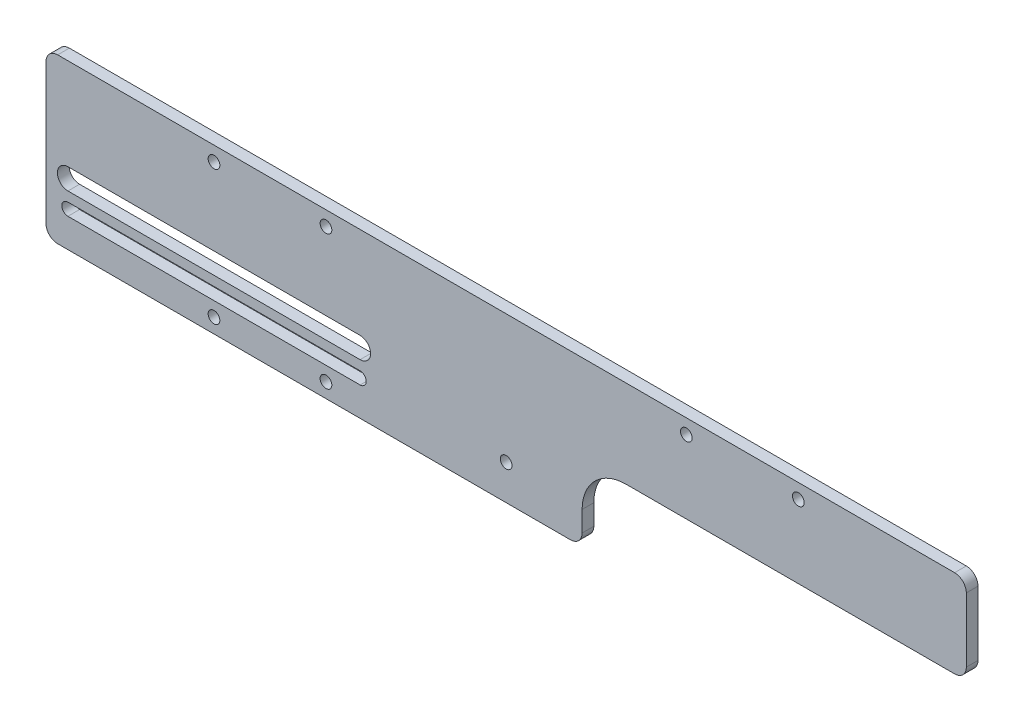
ISO-10303-21;
HEADER;
FILE_DESCRIPTION(('STEP AP214'),'2;1');
FILE_NAME('part.step','',(''),(''),'','','');
FILE_SCHEMA(('AUTOMOTIVE_DESIGN { 1 0 10303 214 1 1 1 1 }'));
ENDSEC;
DATA;
#1=APPLICATION_CONTEXT('core data for automotive mechanical design processes');
#2=APPLICATION_PROTOCOL_DEFINITION('international standard','automotive_design',2000,#1);
#3=PRODUCT_CONTEXT('',#1,'mechanical');
#4=PRODUCT('Part','Part','',(#3));
#5=PRODUCT_RELATED_PRODUCT_CATEGORY('part','',(#4));
#6=PRODUCT_DEFINITION_FORMATION('','',#4);
#7=PRODUCT_DEFINITION_CONTEXT('part definition',#1,'design');
#8=PRODUCT_DEFINITION('design','',#6,#7);
#9=PRODUCT_DEFINITION_SHAPE('','',#8);
#10=(LENGTH_UNIT() NAMED_UNIT(*) SI_UNIT(.MILLI.,.METRE.));
#11=(NAMED_UNIT(*) PLANE_ANGLE_UNIT() SI_UNIT($,.RADIAN.));
#12=(NAMED_UNIT(*) SI_UNIT($,.STERADIAN.) SOLID_ANGLE_UNIT());
#13=UNCERTAINTY_MEASURE_WITH_UNIT(LENGTH_MEASURE(1.E-05),#10,'distance_accuracy_value','');
#14=(GEOMETRIC_REPRESENTATION_CONTEXT(3) GLOBAL_UNCERTAINTY_ASSIGNED_CONTEXT((#13)) GLOBAL_UNIT_ASSIGNED_CONTEXT((#10,
#11,#12)) REPRESENTATION_CONTEXT('',''));
#15=CARTESIAN_POINT('',(0.,0.,0.));
#16=DIRECTION('',(0.,0.,1.));
#17=DIRECTION('',(1.,0.,0.));
#18=AXIS2_PLACEMENT_3D('',#15,#16,#17);
#19=CARTESIAN_POINT('',(26.,0.,0.));
#20=DIRECTION('',(1.,0.,0.));
#21=DIRECTION('',(0.,0.,-1.));
#22=AXIS2_PLACEMENT_3D('',#19,#20,#21);
#23=PLANE('',#22);
#24=DIRECTION('',(0.,1.,0.));
#25=VECTOR('',#24,1.);
#26=CARTESIAN_POINT('',(26.,0.,0.));
#27=LINE('',#26,#25);
#28=CARTESIAN_POINT('',(26.,-24.,0.));
#29=VERTEX_POINT('',#28);
#30=CARTESIAN_POINT('',(26.,-17.,0.));
#31=VERTEX_POINT('',#30);
#32=EDGE_CURVE('E253',#29,#31,#27,.T.);
#33=ORIENTED_EDGE('',*,*,#32,.T.);
#34=DIRECTION('',(0.,0.,1.));
#35=VECTOR('',#34,1.);
#36=CARTESIAN_POINT('',(26.,-17.,0.));
#37=LINE('',#36,#35);
#38=CARTESIAN_POINT('',(26.,-17.,4.));
#39=VERTEX_POINT('',#38);
#40=EDGE_CURVE('E242',#31,#39,#37,.T.);
#41=ORIENTED_EDGE('',*,*,#40,.T.);
#42=DIRECTION('',(0.,1.,0.));
#43=VECTOR('',#42,1.);
#44=CARTESIAN_POINT('',(26.,0.,4.));
#45=LINE('',#44,#43);
#46=CARTESIAN_POINT('',(26.,-24.,4.));
#47=VERTEX_POINT('',#46);
#48=EDGE_CURVE('E254',#47,#39,#45,.T.);
#49=ORIENTED_EDGE('',*,*,#48,.F.);
#50=DIRECTION('',(0.,0.,1.));
#51=VECTOR('',#50,1.);
#52=CARTESIAN_POINT('',(26.,-24.,0.));
#53=LINE('',#52,#51);
#54=EDGE_CURVE('E265',#29,#47,#53,.T.);
#55=ORIENTED_EDGE('',*,*,#54,.F.);
#56=EDGE_LOOP('',(#33,#41,#49,#55));
#57=FACE_BOUND('',#56,.T.);
#58=ADVANCED_FACE('F41',(#57),#23,.T.);
#59=CARTESIAN_POINT('',(153.5,-24.,4.));
#60=DIRECTION('',(0.,0.,-1.));
#61=DIRECTION('',(-1.,0.,0.));
#62=AXIS2_PLACEMENT_3D('',#59,#60,#61);
#63=PLANE('',#62);
#64=DIRECTION('',(-1.,0.,0.));
#65=VECTOR('',#64,1.);
#66=CARTESIAN_POINT('',(-50.,-3.40000000000004,4.));
#67=LINE('',#66,#65);
#68=CARTESIAN_POINT('',(-50.,-3.40000000000004,4.));
#69=VERTEX_POINT('',#68);
#70=CARTESIAN_POINT('',(-150.,-3.40000000000005,4.));
#71=VERTEX_POINT('',#70);
#72=EDGE_CURVE('E213',#69,#71,#67,.T.);
#73=ORIENTED_EDGE('',*,*,#72,.F.);
#74=CARTESIAN_POINT('',(-50.,-7.00000000000004,4.));
#75=DIRECTION('',(0.,0.,1.));
#76=DIRECTION('',(1.,0.,0.));
#77=AXIS2_PLACEMENT_3D('',#74,#75,#76);
#78=CIRCLE('',#77,3.6);
#79=CARTESIAN_POINT('',(-50.,-10.6,4.));
#80=VERTEX_POINT('',#79);
#81=EDGE_CURVE('E57',#80,#69,#78,.T.);
#82=ORIENTED_EDGE('',*,*,#81,.F.);
#83=DIRECTION('',(1.,0.,0.));
#84=VECTOR('',#83,1.);
#85=CARTESIAN_POINT('',(-50.,-10.6,4.));
#86=LINE('',#85,#84);
#87=CARTESIAN_POINT('',(-150.,-10.6000000000001,4.));
#88=VERTEX_POINT('',#87);
#89=EDGE_CURVE('E200',#88,#80,#86,.T.);
#90=ORIENTED_EDGE('',*,*,#89,.F.);
#91=CARTESIAN_POINT('',(-150.,-7.00000000000005,4.));
#92=DIRECTION('',(0.,0.,1.));
#93=DIRECTION('',(1.,0.,0.));
#94=AXIS2_PLACEMENT_3D('',#91,#92,#93);
#95=CIRCLE('',#94,3.6);
#96=EDGE_CURVE('E204',#71,#88,#95,.T.);
#97=ORIENTED_EDGE('',*,*,#96,.F.);
#98=EDGE_LOOP('',(#73,#82,#90,#97));
#99=FACE_BOUND('',#98,.T.);
#100=CARTESIAN_POINT('',(0.,-16.0000000000001,4.));
#101=DIRECTION('',(0.,0.,1.));
#102=DIRECTION('',(1.,0.,0.));
#103=AXIS2_PLACEMENT_3D('',#100,#101,#102);
#104=CIRCLE('',#103,2.00000000000001);
#105=CARTESIAN_POINT('',(2.00000000000002,-16.0000000000001,4.));
#106=VERTEX_POINT('',#105);
#107=EDGE_CURVE('E222',#106,#106,#104,.T.);
#108=ORIENTED_EDGE('',*,*,#107,.F.);
#109=EDGE_LOOP('',(#108));
#110=FACE_BOUND('',#109,.T.);
#111=CARTESIAN_POINT('',(41.,-17.,4.));
#112=DIRECTION('',(0.,0.,1.));
#113=DIRECTION('',(1.,0.,0.));
#114=AXIS2_PLACEMENT_3D('',#111,#112,#113);
#115=CIRCLE('',#114,15.);
#116=CARTESIAN_POINT('',(41.,-1.99999999999999,4.));
#117=VERTEX_POINT('',#116);
#118=EDGE_CURVE('E232',#117,#39,#115,.T.);
#119=ORIENTED_EDGE('',*,*,#118,.F.);
#120=DIRECTION('',(1.,0.,0.));
#121=VECTOR('',#120,1.);
#122=CARTESIAN_POINT('',(0.,-1.99999999999999,4.));
#123=LINE('',#122,#121);
#124=CARTESIAN_POINT('',(153.5,-1.99999999999999,4.));
#125=VERTEX_POINT('',#124);
#126=EDGE_CURVE('E276',#117,#125,#123,.T.);
#127=ORIENTED_EDGE('',*,*,#126,.T.);
#128=CARTESIAN_POINT('',(153.5,2.00000000000001,4.));
#129=DIRECTION('',(0.,0.,1.));
#130=DIRECTION('',(1.,0.,0.));
#131=AXIS2_PLACEMENT_3D('',#128,#129,#130);
#132=CIRCLE('',#131,4.);
#133=CARTESIAN_POINT('',(157.5,2.00000000000001,4.));
#134=VERTEX_POINT('',#133);
#135=EDGE_CURVE('E268',#125,#134,#132,.T.);
#136=ORIENTED_EDGE('',*,*,#135,.T.);
#137=DIRECTION('',(0.,1.,0.));
#138=VECTOR('',#137,1.);
#139=CARTESIAN_POINT('',(157.5,-24.,4.));
#140=LINE('',#139,#138);
#141=CARTESIAN_POINT('',(157.5,24.,4.));
#142=VERTEX_POINT('',#141);
#143=EDGE_CURVE('E383',#134,#142,#140,.T.);
#144=ORIENTED_EDGE('',*,*,#143,.T.);
#145=CARTESIAN_POINT('',(153.5,24.,4.));
#146=DIRECTION('',(0.,0.,1.));
#147=DIRECTION('',(1.,0.,0.));
#148=AXIS2_PLACEMENT_3D('',#145,#146,#147);
#149=CIRCLE('',#148,4.00000000000001);
#150=CARTESIAN_POINT('',(153.5,28.,4.));
#151=VERTEX_POINT('',#150);
#152=EDGE_CURVE('E386',#142,#151,#149,.T.);
#153=ORIENTED_EDGE('',*,*,#152,.T.);
#154=DIRECTION('',(-1.,0.,0.));
#155=VECTOR('',#154,1.);
#156=CARTESIAN_POINT('',(153.5,28.,4.));
#157=LINE('',#156,#155);
#158=CARTESIAN_POINT('',(-153.5,28.,4.));
#159=VERTEX_POINT('',#158);
#160=EDGE_CURVE('E390',#151,#159,#157,.T.);
#161=ORIENTED_EDGE('',*,*,#160,.T.);
#162=CARTESIAN_POINT('',(-153.5,24.,4.));
#163=DIRECTION('',(0.,0.,1.));
#164=DIRECTION('',(-1.,0.,0.));
#165=AXIS2_PLACEMENT_3D('',#162,#163,#164);
#166=CIRCLE('',#165,4.00000000000001);
#167=CARTESIAN_POINT('',(-157.5,24.,4.));
#168=VERTEX_POINT('',#167);
#169=EDGE_CURVE('E393',#159,#168,#166,.T.);
#170=ORIENTED_EDGE('',*,*,#169,.T.);
#171=DIRECTION('',(0.,-1.,0.));
#172=VECTOR('',#171,1.);
#173=CARTESIAN_POINT('',(-157.5,-24.0000000000001,4.));
#174=LINE('',#173,#172);
#175=CARTESIAN_POINT('',(-157.5,-24.0000000000001,4.));
#176=VERTEX_POINT('',#175);
#177=EDGE_CURVE('E396',#168,#176,#174,.T.);
#178=ORIENTED_EDGE('',*,*,#177,.T.);
#179=CARTESIAN_POINT('',(-153.5,-24.0000000000001,4.));
#180=DIRECTION('',(0.,0.,1.));
#181=DIRECTION('',(1.,0.,0.));
#182=AXIS2_PLACEMENT_3D('',#179,#180,#181);
#183=CIRCLE('',#182,4.00000000000001);
#184=CARTESIAN_POINT('',(-153.5,-28.0000000000001,4.));
#185=VERTEX_POINT('',#184);
#186=EDGE_CURVE('E399',#176,#185,#183,.T.);
#187=ORIENTED_EDGE('',*,*,#186,.T.);
#188=DIRECTION('',(1.,0.,0.));
#189=VECTOR('',#188,1.);
#190=CARTESIAN_POINT('',(153.5,-28.,4.));
#191=LINE('',#190,#189);
#192=CARTESIAN_POINT('',(21.9999999999999,-28.,4.));
#193=VERTEX_POINT('',#192);
#194=EDGE_CURVE('E402',#185,#193,#191,.T.);
#195=ORIENTED_EDGE('',*,*,#194,.T.);
#196=CARTESIAN_POINT('',(22.,-24.,4.));
#197=DIRECTION('',(0.,0.,1.));
#198=DIRECTION('',(1.,0.,0.));
#199=AXIS2_PLACEMENT_3D('',#196,#197,#198);
#200=CIRCLE('',#199,4.);
#201=EDGE_CURVE('E246',#47,#193,#200,.F.);
#202=ORIENTED_EDGE('',*,*,#201,.F.);
#203=ORIENTED_EDGE('',*,*,#48,.T.);
#204=EDGE_LOOP('',(#119,#127,#136,#144,#153,#161,#170,#178,#187,#195,#202,#203));
#205=FACE_BOUND('',#204,.T.);
#206=CARTESIAN_POINT('',(-150.,-16.0000000000001,4.));
#207=DIRECTION('',(0.,0.,1.));
#208=DIRECTION('',(1.,0.,0.));
#209=AXIS2_PLACEMENT_3D('',#206,#207,#208);
#210=CIRCLE('',#209,2.1);
#211=CARTESIAN_POINT('',(-150.,-13.9000000000001,4.));
#212=VERTEX_POINT('',#211);
#213=CARTESIAN_POINT('',(-150.,-18.1000000000001,4.));
#214=VERTEX_POINT('',#213);
#215=EDGE_CURVE('E340',#212,#214,#210,.T.);
#216=ORIENTED_EDGE('',*,*,#215,.F.);
#217=DIRECTION('',(-1.,0.,0.));
#218=VECTOR('',#217,1.);
#219=CARTESIAN_POINT('',(-150.,-13.9000000000001,4.));
#220=LINE('',#219,#218);
#221=CARTESIAN_POINT('',(-50.,-13.9,4.));
#222=VERTEX_POINT('',#221);
#223=EDGE_CURVE('E351',#222,#212,#220,.T.);
#224=ORIENTED_EDGE('',*,*,#223,.F.);
#225=CARTESIAN_POINT('',(-50.,-16.,4.));
#226=DIRECTION('',(0.,0.,1.));
#227=DIRECTION('',(1.,0.,0.));
#228=AXIS2_PLACEMENT_3D('',#225,#226,#227);
#229=CIRCLE('',#228,2.1);
#230=CARTESIAN_POINT('',(-50.,-18.1,4.));
#231=VERTEX_POINT('',#230);
#232=EDGE_CURVE('E347',#231,#222,#229,.T.);
#233=ORIENTED_EDGE('',*,*,#232,.F.);
#234=DIRECTION('',(1.,0.,0.));
#235=VECTOR('',#234,1.);
#236=CARTESIAN_POINT('',(-150.,-18.1000000000001,4.));
#237=LINE('',#236,#235);
#238=EDGE_CURVE('E343',#214,#231,#237,.T.);
#239=ORIENTED_EDGE('',*,*,#238,.F.);
#240=EDGE_LOOP('',(#216,#224,#233,#239));
#241=FACE_BOUND('',#240,.T.);
#242=CARTESIAN_POINT('',(-100.,23.,4.));
#243=DIRECTION('',(0.,0.,1.));
#244=DIRECTION('',(1.,0.,0.));
#245=AXIS2_PLACEMENT_3D('',#242,#243,#244);
#246=CIRCLE('',#245,2.);
#247=CARTESIAN_POINT('',(-98.,23.,4.));
#248=VERTEX_POINT('',#247);
#249=EDGE_CURVE('E332',#248,#248,#246,.T.);
#250=ORIENTED_EDGE('',*,*,#249,.F.);
#251=EDGE_LOOP('',(#250));
#252=FACE_BOUND('',#251,.T.);
#253=CARTESIAN_POINT('',(-61.67,23.,4.));
#254=DIRECTION('',(0.,0.,1.));
#255=DIRECTION('',(1.,0.,0.));
#256=AXIS2_PLACEMENT_3D('',#253,#254,#255);
#257=CIRCLE('',#256,2.);
#258=CARTESIAN_POINT('',(-59.67,23.,4.));
#259=VERTEX_POINT('',#258);
#260=EDGE_CURVE('E324',#259,#259,#257,.T.);
#261=ORIENTED_EDGE('',*,*,#260,.F.);
#262=EDGE_LOOP('',(#261));
#263=FACE_BOUND('',#262,.T.);
#264=CARTESIAN_POINT('',(-100.,-23.,4.));
#265=DIRECTION('',(0.,0.,1.));
#266=DIRECTION('',(1.,0.,0.));
#267=AXIS2_PLACEMENT_3D('',#264,#265,#266);
#268=CIRCLE('',#267,2.);
#269=CARTESIAN_POINT('',(-98.,-23.,4.));
#270=VERTEX_POINT('',#269);
#271=EDGE_CURVE('E316',#270,#270,#268,.T.);
#272=ORIENTED_EDGE('',*,*,#271,.F.);
#273=EDGE_LOOP('',(#272));
#274=FACE_BOUND('',#273,.T.);
#275=CARTESIAN_POINT('',(-61.67,-23.,4.));
#276=DIRECTION('',(0.,0.,1.));
#277=DIRECTION('',(1.,0.,0.));
#278=AXIS2_PLACEMENT_3D('',#275,#276,#277);
#279=CIRCLE('',#278,2.);
#280=CARTESIAN_POINT('',(-59.67,-23.,4.));
#281=VERTEX_POINT('',#280);
#282=EDGE_CURVE('E308',#281,#281,#279,.T.);
#283=ORIENTED_EDGE('',*,*,#282,.F.);
#284=EDGE_LOOP('',(#283));
#285=FACE_BOUND('',#284,.T.);
#286=CARTESIAN_POINT('',(61.67,23.,4.));
#287=DIRECTION('',(0.,0.,1.));
#288=DIRECTION('',(-1.,0.,0.));
#289=AXIS2_PLACEMENT_3D('',#286,#287,#288);
#290=CIRCLE('',#289,1.99999999999998);
#291=CARTESIAN_POINT('',(59.67,23.,4.));
#292=VERTEX_POINT('',#291);
#293=EDGE_CURVE('E300',#292,#292,#290,.T.);
#294=ORIENTED_EDGE('',*,*,#293,.F.);
#295=EDGE_LOOP('',(#294));
#296=FACE_BOUND('',#295,.T.);
#297=CARTESIAN_POINT('',(100.,23.,4.));
#298=DIRECTION('',(0.,0.,1.));
#299=DIRECTION('',(-1.,0.,0.));
#300=AXIS2_PLACEMENT_3D('',#297,#298,#299);
#301=CIRCLE('',#300,2.);
#302=CARTESIAN_POINT('',(98.,23.,4.));
#303=VERTEX_POINT('',#302);
#304=EDGE_CURVE('E292',#303,#303,#301,.T.);
#305=ORIENTED_EDGE('',*,*,#304,.F.);
#306=EDGE_LOOP('',(#305));
#307=FACE_BOUND('',#306,.T.);
#308=ADVANCED_FACE('F468',(#99,#110,#205,#241,#252,#263,#274,#285,#296,#307),#63,.F.);
#309=CARTESIAN_POINT('',(153.5,-24.,0.));
#310=DIRECTION('',(0.,0.,-1.));
#311=DIRECTION('',(-1.,0.,0.));
#312=AXIS2_PLACEMENT_3D('',#309,#310,#311);
#313=PLANE('',#312);
#314=CARTESIAN_POINT('',(-50.,-7.00000000000004,0.));
#315=DIRECTION('',(0.,0.,1.));
#316=DIRECTION('',(1.,0.,0.));
#317=AXIS2_PLACEMENT_3D('',#314,#315,#316);
#318=CIRCLE('',#317,3.6);
#319=CARTESIAN_POINT('',(-50.,-10.6,0.));
#320=VERTEX_POINT('',#319);
#321=CARTESIAN_POINT('',(-50.,-3.40000000000004,0.));
#322=VERTEX_POINT('',#321);
#323=EDGE_CURVE('E181',#320,#322,#318,.T.);
#324=ORIENTED_EDGE('',*,*,#323,.T.);
#325=DIRECTION('',(-1.,0.,0.));
#326=VECTOR('',#325,1.);
#327=CARTESIAN_POINT('',(-50.,-3.40000000000004,0.));
#328=LINE('',#327,#326);
#329=CARTESIAN_POINT('',(-150.,-3.40000000000005,0.));
#330=VERTEX_POINT('',#329);
#331=EDGE_CURVE('E191',#322,#330,#328,.T.);
#332=ORIENTED_EDGE('',*,*,#331,.T.);
#333=CARTESIAN_POINT('',(-150.,-7.00000000000005,0.));
#334=DIRECTION('',(0.,0.,1.));
#335=DIRECTION('',(1.,0.,0.));
#336=AXIS2_PLACEMENT_3D('',#333,#334,#335);
#337=CIRCLE('',#336,3.6);
#338=CARTESIAN_POINT('',(-150.,-10.6000000000001,0.));
#339=VERTEX_POINT('',#338);
#340=EDGE_CURVE('E65',#330,#339,#337,.T.);
#341=ORIENTED_EDGE('',*,*,#340,.T.);
#342=DIRECTION('',(1.,0.,0.));
#343=VECTOR('',#342,1.);
#344=CARTESIAN_POINT('',(-50.,-10.6,0.));
#345=LINE('',#344,#343);
#346=EDGE_CURVE('E188',#339,#320,#345,.T.);
#347=ORIENTED_EDGE('',*,*,#346,.T.);
#348=EDGE_LOOP('',(#324,#332,#341,#347));
#349=FACE_BOUND('',#348,.T.);
#350=CARTESIAN_POINT('',(0.,-16.0000000000001,0.));
#351=DIRECTION('',(0.,0.,1.));
#352=DIRECTION('',(1.,0.,0.));
#353=AXIS2_PLACEMENT_3D('',#350,#351,#352);
#354=CIRCLE('',#353,2.00000000000001);
#355=CARTESIAN_POINT('',(2.00000000000002,-16.0000000000001,0.));
#356=VERTEX_POINT('',#355);
#357=EDGE_CURVE('E228',#356,#356,#354,.T.);
#358=ORIENTED_EDGE('',*,*,#357,.T.);
#359=EDGE_LOOP('',(#358));
#360=FACE_BOUND('',#359,.T.);
#361=DIRECTION('',(1.,0.,0.));
#362=VECTOR('',#361,1.);
#363=CARTESIAN_POINT('',(0.,-1.99999999999999,0.));
#364=LINE('',#363,#362);
#365=CARTESIAN_POINT('',(41.,-1.99999999999999,0.));
#366=VERTEX_POINT('',#365);
#367=CARTESIAN_POINT('',(153.5,-1.99999999999999,0.));
#368=VERTEX_POINT('',#367);
#369=EDGE_CURVE('E275',#366,#368,#364,.T.);
#370=ORIENTED_EDGE('',*,*,#369,.F.);
#371=CARTESIAN_POINT('',(41.,-17.,0.));
#372=DIRECTION('',(0.,0.,1.));
#373=DIRECTION('',(1.,0.,0.));
#374=AXIS2_PLACEMENT_3D('',#371,#372,#373);
#375=CIRCLE('',#374,15.);
#376=EDGE_CURVE('E236',#366,#31,#375,.T.);
#377=ORIENTED_EDGE('',*,*,#376,.T.);
#378=ORIENTED_EDGE('',*,*,#32,.F.);
#379=CARTESIAN_POINT('',(22.,-24.,0.));
#380=DIRECTION('',(0.,0.,1.));
#381=DIRECTION('',(1.,0.,0.));
#382=AXIS2_PLACEMENT_3D('',#379,#380,#381);
#383=CIRCLE('',#382,4.);
#384=CARTESIAN_POINT('',(21.9999999999999,-28.,0.));
#385=VERTEX_POINT('',#384);
#386=EDGE_CURVE('E249',#29,#385,#383,.F.);
#387=ORIENTED_EDGE('',*,*,#386,.T.);
#388=DIRECTION('',(1.,0.,0.));
#389=VECTOR('',#388,1.);
#390=CARTESIAN_POINT('',(153.5,-28.,0.));
#391=LINE('',#390,#389);
#392=CARTESIAN_POINT('',(-153.5,-28.0000000000001,0.));
#393=VERTEX_POINT('',#392);
#394=EDGE_CURVE('E387',#393,#385,#391,.T.);
#395=ORIENTED_EDGE('',*,*,#394,.F.);
#396=CARTESIAN_POINT('',(-153.5,-24.0000000000001,0.));
#397=DIRECTION('',(0.,0.,1.));
#398=DIRECTION('',(1.,0.,0.));
#399=AXIS2_PLACEMENT_3D('',#396,#397,#398);
#400=CIRCLE('',#399,4.00000000000001);
#401=CARTESIAN_POINT('',(-157.5,-24.0000000000001,0.));
#402=VERTEX_POINT('',#401);
#403=EDGE_CURVE('E420',#402,#393,#400,.T.);
#404=ORIENTED_EDGE('',*,*,#403,.F.);
#405=DIRECTION('',(0.,-1.,0.));
#406=VECTOR('',#405,1.);
#407=CARTESIAN_POINT('',(-157.5,-24.0000000000001,0.));
#408=LINE('',#407,#406);
#409=CARTESIAN_POINT('',(-157.5,24.,0.));
#410=VERTEX_POINT('',#409);
#411=EDGE_CURVE('E417',#410,#402,#408,.T.);
#412=ORIENTED_EDGE('',*,*,#411,.F.);
#413=CARTESIAN_POINT('',(-153.5,24.,0.));
#414=DIRECTION('',(0.,0.,1.));
#415=DIRECTION('',(-1.,0.,0.));
#416=AXIS2_PLACEMENT_3D('',#413,#414,#415);
#417=CIRCLE('',#416,4.00000000000001);
#418=CARTESIAN_POINT('',(-153.5,28.,0.));
#419=VERTEX_POINT('',#418);
#420=EDGE_CURVE('E414',#419,#410,#417,.T.);
#421=ORIENTED_EDGE('',*,*,#420,.F.);
#422=DIRECTION('',(-1.,0.,0.));
#423=VECTOR('',#422,1.);
#424=CARTESIAN_POINT('',(153.5,28.,0.));
#425=LINE('',#424,#423);
#426=CARTESIAN_POINT('',(153.5,28.,0.));
#427=VERTEX_POINT('',#426);
#428=EDGE_CURVE('E411',#427,#419,#425,.T.);
#429=ORIENTED_EDGE('',*,*,#428,.F.);
#430=CARTESIAN_POINT('',(153.5,24.,0.));
#431=DIRECTION('',(0.,0.,1.));
#432=DIRECTION('',(1.,0.,0.));
#433=AXIS2_PLACEMENT_3D('',#430,#431,#432);
#434=CIRCLE('',#433,4.00000000000001);
#435=CARTESIAN_POINT('',(157.5,24.,0.));
#436=VERTEX_POINT('',#435);
#437=EDGE_CURVE('E408',#436,#427,#434,.T.);
#438=ORIENTED_EDGE('',*,*,#437,.F.);
#439=DIRECTION('',(0.,1.,0.));
#440=VECTOR('',#439,1.);
#441=CARTESIAN_POINT('',(157.5,-24.,0.));
#442=LINE('',#441,#440);
#443=CARTESIAN_POINT('',(157.5,2.00000000000001,0.));
#444=VERTEX_POINT('',#443);
#445=EDGE_CURVE('E382',#444,#436,#442,.T.);
#446=ORIENTED_EDGE('',*,*,#445,.F.);
#447=CARTESIAN_POINT('',(153.5,2.00000000000001,0.));
#448=DIRECTION('',(0.,0.,1.));
#449=DIRECTION('',(1.,0.,0.));
#450=AXIS2_PLACEMENT_3D('',#447,#448,#449);
#451=CIRCLE('',#450,4.);
#452=EDGE_CURVE('E272',#368,#444,#451,.T.);
#453=ORIENTED_EDGE('',*,*,#452,.F.);
#454=EDGE_LOOP('',(#370,#377,#378,#387,#395,#404,#412,#421,#429,#438,#446,#453));
#455=FACE_BOUND('',#454,.T.);
#456=CARTESIAN_POINT('',(-100.,-23.,0.));
#457=DIRECTION('',(0.,0.,1.));
#458=DIRECTION('',(1.,0.,0.));
#459=AXIS2_PLACEMENT_3D('',#456,#457,#458);
#460=CIRCLE('',#459,2.);
#461=CARTESIAN_POINT('',(-98.,-23.,0.));
#462=VERTEX_POINT('',#461);
#463=EDGE_CURVE('E312',#462,#462,#460,.T.);
#464=ORIENTED_EDGE('',*,*,#463,.T.);
#465=EDGE_LOOP('',(#464));
#466=FACE_BOUND('',#465,.T.);
#467=CARTESIAN_POINT('',(-100.,23.,0.));
#468=DIRECTION('',(0.,0.,1.));
#469=DIRECTION('',(1.,0.,0.));
#470=AXIS2_PLACEMENT_3D('',#467,#468,#469);
#471=CIRCLE('',#470,2.);
#472=CARTESIAN_POINT('',(-98.,23.,0.));
#473=VERTEX_POINT('',#472);
#474=EDGE_CURVE('E328',#473,#473,#471,.T.);
#475=ORIENTED_EDGE('',*,*,#474,.T.);
#476=EDGE_LOOP('',(#475));
#477=FACE_BOUND('',#476,.T.);
#478=DIRECTION('',(-1.,0.,0.));
#479=VECTOR('',#478,1.);
#480=CARTESIAN_POINT('',(-150.,-13.9000000000001,0.));
#481=LINE('',#480,#479);
#482=CARTESIAN_POINT('',(-50.,-13.9,0.));
#483=VERTEX_POINT('',#482);
#484=CARTESIAN_POINT('',(-150.,-13.9000000000001,0.));
#485=VERTEX_POINT('',#484);
#486=EDGE_CURVE('E344',#483,#485,#481,.T.);
#487=ORIENTED_EDGE('',*,*,#486,.T.);
#488=CARTESIAN_POINT('',(-150.,-16.0000000000001,0.));
#489=DIRECTION('',(0.,0.,1.));
#490=DIRECTION('',(1.,0.,0.));
#491=AXIS2_PLACEMENT_3D('',#488,#489,#490);
#492=CIRCLE('',#491,2.1);
#493=CARTESIAN_POINT('',(-150.,-18.1000000000001,0.));
#494=VERTEX_POINT('',#493);
#495=EDGE_CURVE('E336',#485,#494,#492,.T.);
#496=ORIENTED_EDGE('',*,*,#495,.T.);
#497=DIRECTION('',(1.,0.,0.));
#498=VECTOR('',#497,1.);
#499=CARTESIAN_POINT('',(-150.,-18.1000000000001,0.));
#500=LINE('',#499,#498);
#501=CARTESIAN_POINT('',(-50.,-18.1,0.));
#502=VERTEX_POINT('',#501);
#503=EDGE_CURVE('E358',#494,#502,#500,.T.);
#504=ORIENTED_EDGE('',*,*,#503,.T.);
#505=CARTESIAN_POINT('',(-50.,-16.,0.));
#506=DIRECTION('',(0.,0.,1.));
#507=DIRECTION('',(1.,0.,0.));
#508=AXIS2_PLACEMENT_3D('',#505,#506,#507);
#509=CIRCLE('',#508,2.1);
#510=EDGE_CURVE('E362',#502,#483,#509,.T.);
#511=ORIENTED_EDGE('',*,*,#510,.T.);
#512=EDGE_LOOP('',(#487,#496,#504,#511));
#513=FACE_BOUND('',#512,.T.);
#514=CARTESIAN_POINT('',(-61.67,23.,0.));
#515=DIRECTION('',(0.,0.,1.));
#516=DIRECTION('',(1.,0.,0.));
#517=AXIS2_PLACEMENT_3D('',#514,#515,#516);
#518=CIRCLE('',#517,2.);
#519=CARTESIAN_POINT('',(-59.67,23.,0.));
#520=VERTEX_POINT('',#519);
#521=EDGE_CURVE('E320',#520,#520,#518,.T.);
#522=ORIENTED_EDGE('',*,*,#521,.T.);
#523=EDGE_LOOP('',(#522));
#524=FACE_BOUND('',#523,.T.);
#525=CARTESIAN_POINT('',(-61.67,-23.,0.));
#526=DIRECTION('',(0.,0.,1.));
#527=DIRECTION('',(1.,0.,0.));
#528=AXIS2_PLACEMENT_3D('',#525,#526,#527);
#529=CIRCLE('',#528,2.);
#530=CARTESIAN_POINT('',(-59.67,-23.,0.));
#531=VERTEX_POINT('',#530);
#532=EDGE_CURVE('E304',#531,#531,#529,.T.);
#533=ORIENTED_EDGE('',*,*,#532,.T.);
#534=EDGE_LOOP('',(#533));
#535=FACE_BOUND('',#534,.T.);
#536=CARTESIAN_POINT('',(100.,23.,0.));
#537=DIRECTION('',(0.,0.,1.));
#538=DIRECTION('',(-1.,0.,0.));
#539=AXIS2_PLACEMENT_3D('',#536,#537,#538);
#540=CIRCLE('',#539,2.);
#541=CARTESIAN_POINT('',(98.,23.,0.));
#542=VERTEX_POINT('',#541);
#543=EDGE_CURVE('E288',#542,#542,#540,.T.);
#544=ORIENTED_EDGE('',*,*,#543,.T.);
#545=EDGE_LOOP('',(#544));
#546=FACE_BOUND('',#545,.T.);
#547=CARTESIAN_POINT('',(61.67,23.,0.));
#548=DIRECTION('',(0.,0.,1.));
#549=DIRECTION('',(-1.,0.,0.));
#550=AXIS2_PLACEMENT_3D('',#547,#548,#549);
#551=CIRCLE('',#550,1.99999999999998);
#552=CARTESIAN_POINT('',(59.67,23.,0.));
#553=VERTEX_POINT('',#552);
#554=EDGE_CURVE('E296',#553,#553,#551,.T.);
#555=ORIENTED_EDGE('',*,*,#554,.T.);
#556=EDGE_LOOP('',(#555));
#557=FACE_BOUND('',#556,.T.);
#558=ADVANCED_FACE('F196',(#349,#360,#455,#466,#477,#513,#524,#535,#546,#557),#313,.T.);
#559=CARTESIAN_POINT('',(157.5,-24.,4.));
#560=DIRECTION('',(-1.,0.,0.));
#561=DIRECTION('',(0.,-1.,0.));
#562=AXIS2_PLACEMENT_3D('',#559,#560,#561);
#563=PLANE('',#562);
#564=DIRECTION('',(0.,0.,1.));
#565=VECTOR('',#564,1.);
#566=CARTESIAN_POINT('',(157.5,2.00000000000001,0.));
#567=LINE('',#566,#565);
#568=EDGE_CURVE('E285',#444,#134,#567,.T.);
#569=ORIENTED_EDGE('',*,*,#568,.F.);
#570=ORIENTED_EDGE('',*,*,#445,.T.);
#571=DIRECTION('',(0.,0.,-1.));
#572=VECTOR('',#571,1.);
#573=CARTESIAN_POINT('',(157.5,24.,4.));
#574=LINE('',#573,#572);
#575=EDGE_CURVE('E11',#142,#436,#574,.T.);
#576=ORIENTED_EDGE('',*,*,#575,.F.);
#577=ORIENTED_EDGE('',*,*,#143,.F.);
#578=EDGE_LOOP('',(#569,#570,#576,#577));
#579=FACE_BOUND('',#578,.T.);
#580=ADVANCED_FACE('F43',(#579),#563,.F.);
#581=CARTESIAN_POINT('',(153.5,24.,4.));
#582=DIRECTION('',(0.,0.,-1.));
#583=DIRECTION('',(-1.,0.,0.));
#584=AXIS2_PLACEMENT_3D('',#581,#582,#583);
#585=CYLINDRICAL_SURFACE('',#584,4.00000000000001);
#586=ORIENTED_EDGE('',*,*,#437,.T.);
#587=DIRECTION('',(0.,0.,-1.));
#588=VECTOR('',#587,1.);
#589=CARTESIAN_POINT('',(153.5,28.,4.));
#590=LINE('',#589,#588);
#591=EDGE_CURVE('E50',#151,#427,#590,.T.);
#592=ORIENTED_EDGE('',*,*,#591,.F.);
#593=ORIENTED_EDGE('',*,*,#152,.F.);
#594=ORIENTED_EDGE('',*,*,#575,.T.);
#595=EDGE_LOOP('',(#586,#592,#593,#594));
#596=FACE_BOUND('',#595,.T.);
#597=ADVANCED_FACE('F473',(#596),#585,.T.);
#598=CARTESIAN_POINT('',(153.5,28.,4.));
#599=DIRECTION('',(0.,-1.,0.));
#600=DIRECTION('',(1.,0.,0.));
#601=AXIS2_PLACEMENT_3D('',#598,#599,#600);
#602=PLANE('',#601);
#603=ORIENTED_EDGE('',*,*,#428,.T.);
#604=DIRECTION('',(0.,0.,-1.));
#605=VECTOR('',#604,1.);
#606=CARTESIAN_POINT('',(-153.5,28.,4.));
#607=LINE('',#606,#605);
#608=EDGE_CURVE('E436',#159,#419,#607,.T.);
#609=ORIENTED_EDGE('',*,*,#608,.F.);
#610=ORIENTED_EDGE('',*,*,#160,.F.);
#611=ORIENTED_EDGE('',*,*,#591,.T.);
#612=EDGE_LOOP('',(#603,#609,#610,#611));
#613=FACE_BOUND('',#612,.T.);
#614=ADVANCED_FACE('F445',(#613),#602,.F.);
#615=CARTESIAN_POINT('',(-153.5,24.,4.));
#616=DIRECTION('',(0.,0.,-1.));
#617=DIRECTION('',(-1.,0.,0.));
#618=AXIS2_PLACEMENT_3D('',#615,#616,#617);
#619=CYLINDRICAL_SURFACE('',#618,4.00000000000001);
#620=ORIENTED_EDGE('',*,*,#420,.T.);
#621=DIRECTION('',(0.,0.,-1.));
#622=VECTOR('',#621,1.);
#623=CARTESIAN_POINT('',(-157.5,24.,4.));
#624=LINE('',#623,#622);
#625=EDGE_CURVE('E432',#168,#410,#624,.T.);
#626=ORIENTED_EDGE('',*,*,#625,.F.);
#627=ORIENTED_EDGE('',*,*,#169,.F.);
#628=ORIENTED_EDGE('',*,*,#608,.T.);
#629=EDGE_LOOP('',(#620,#626,#627,#628));
#630=FACE_BOUND('',#629,.T.);
#631=ADVANCED_FACE('F459',(#630),#619,.T.);
#632=CARTESIAN_POINT('',(-157.5,-24.0000000000001,4.));
#633=DIRECTION('',(1.,0.,0.));
#634=DIRECTION('',(0.,1.,0.));
#635=AXIS2_PLACEMENT_3D('',#632,#633,#634);
#636=PLANE('',#635);
#637=ORIENTED_EDGE('',*,*,#411,.T.);
#638=DIRECTION('',(0.,0.,-1.));
#639=VECTOR('',#638,1.);
#640=CARTESIAN_POINT('',(-157.5,-24.0000000000001,4.));
#641=LINE('',#640,#639);
#642=EDGE_CURVE('E428',#176,#402,#641,.T.);
#643=ORIENTED_EDGE('',*,*,#642,.F.);
#644=ORIENTED_EDGE('',*,*,#177,.F.);
#645=ORIENTED_EDGE('',*,*,#625,.T.);
#646=EDGE_LOOP('',(#637,#643,#644,#645));
#647=FACE_BOUND('',#646,.T.);
#648=ADVANCED_FACE('F463',(#647),#636,.F.);
#649=CARTESIAN_POINT('',(-153.5,-24.0000000000001,4.));
#650=DIRECTION('',(0.,0.,-1.));
#651=DIRECTION('',(-1.,0.,0.));
#652=AXIS2_PLACEMENT_3D('',#649,#650,#651);
#653=CYLINDRICAL_SURFACE('',#652,4.00000000000001);
#654=ORIENTED_EDGE('',*,*,#403,.T.);
#655=DIRECTION('',(0.,0.,-1.));
#656=VECTOR('',#655,1.);
#657=CARTESIAN_POINT('',(-153.5,-28.0000000000001,4.));
#658=LINE('',#657,#656);
#659=EDGE_CURVE('E405',#185,#393,#658,.T.);
#660=ORIENTED_EDGE('',*,*,#659,.F.);
#661=ORIENTED_EDGE('',*,*,#186,.F.);
#662=ORIENTED_EDGE('',*,*,#642,.T.);
#663=EDGE_LOOP('',(#654,#660,#661,#662));
#664=FACE_BOUND('',#663,.T.);
#665=ADVANCED_FACE('F501',(#664),#653,.T.);
#666=CARTESIAN_POINT('',(153.5,-28.,4.));
#667=DIRECTION('',(0.,1.,0.));
#668=DIRECTION('',(-1.,0.,0.));
#669=AXIS2_PLACEMENT_3D('',#666,#667,#668);
#670=PLANE('',#669);
#671=ORIENTED_EDGE('',*,*,#394,.T.);
#672=DIRECTION('',(0.,0.,1.));
#673=VECTOR('',#672,1.);
#674=CARTESIAN_POINT('',(21.9999999999999,-28.,0.));
#675=LINE('',#674,#673);
#676=EDGE_CURVE('E258',#385,#193,#675,.T.);
#677=ORIENTED_EDGE('',*,*,#676,.T.);
#678=ORIENTED_EDGE('',*,*,#194,.F.);
#679=ORIENTED_EDGE('',*,*,#659,.T.);
#680=EDGE_LOOP('',(#671,#677,#678,#679));
#681=FACE_BOUND('',#680,.T.);
#682=ADVANCED_FACE('F499',(#681),#670,.F.);
#683=CARTESIAN_POINT('',(-150.,-16.0000000000001,4.));
#684=DIRECTION('',(0.,0.,-1.));
#685=DIRECTION('',(-1.,0.,0.));
#686=AXIS2_PLACEMENT_3D('',#683,#684,#685);
#687=CYLINDRICAL_SURFACE('',#686,2.1);
#688=ORIENTED_EDGE('',*,*,#495,.F.);
#689=DIRECTION('',(0.,0.,-1.));
#690=VECTOR('',#689,1.);
#691=CARTESIAN_POINT('',(-150.,-13.9000000000001,4.));
#692=LINE('',#691,#690);
#693=EDGE_CURVE('E354',#212,#485,#692,.T.);
#694=ORIENTED_EDGE('',*,*,#693,.F.);
#695=ORIENTED_EDGE('',*,*,#215,.T.);
#696=DIRECTION('',(0.,0.,-1.));
#697=VECTOR('',#696,1.);
#698=CARTESIAN_POINT('',(-150.,-18.1000000000001,4.));
#699=LINE('',#698,#697);
#700=EDGE_CURVE('E378',#214,#494,#699,.T.);
#701=ORIENTED_EDGE('',*,*,#700,.T.);
#702=EDGE_LOOP('',(#688,#694,#695,#701));
#703=FACE_BOUND('',#702,.T.);
#704=ADVANCED_FACE('F508',(#703),#687,.F.);
#705=CARTESIAN_POINT('',(-150.,-18.1000000000001,4.));
#706=DIRECTION('',(0.,1.,0.));
#707=DIRECTION('',(-1.,0.,0.));
#708=AXIS2_PLACEMENT_3D('',#705,#706,#707);
#709=PLANE('',#708);
#710=ORIENTED_EDGE('',*,*,#503,.F.);
#711=ORIENTED_EDGE('',*,*,#700,.F.);
#712=ORIENTED_EDGE('',*,*,#238,.T.);
#713=DIRECTION('',(0.,0.,-1.));
#714=VECTOR('',#713,1.);
#715=CARTESIAN_POINT('',(-50.,-18.1,4.));
#716=LINE('',#715,#714);
#717=EDGE_CURVE('E375',#231,#502,#716,.T.);
#718=ORIENTED_EDGE('',*,*,#717,.T.);
#719=EDGE_LOOP('',(#710,#711,#712,#718));
#720=FACE_BOUND('',#719,.T.);
#721=ADVANCED_FACE('F558',(#720),#709,.T.);
#722=CARTESIAN_POINT('',(-50.,-16.,4.));
#723=DIRECTION('',(0.,0.,-1.));
#724=DIRECTION('',(-1.,0.,0.));
#725=AXIS2_PLACEMENT_3D('',#722,#723,#724);
#726=CYLINDRICAL_SURFACE('',#725,2.1);
#727=ORIENTED_EDGE('',*,*,#510,.F.);
#728=ORIENTED_EDGE('',*,*,#717,.F.);
#729=ORIENTED_EDGE('',*,*,#232,.T.);
#730=DIRECTION('',(0.,0.,-1.));
#731=VECTOR('',#730,1.);
#732=CARTESIAN_POINT('',(-50.,-13.9,4.));
#733=LINE('',#732,#731);
#734=EDGE_CURVE('E372',#222,#483,#733,.T.);
#735=ORIENTED_EDGE('',*,*,#734,.T.);
#736=EDGE_LOOP('',(#727,#728,#729,#735));
#737=FACE_BOUND('',#736,.T.);
#738=ADVANCED_FACE('F554',(#737),#726,.F.);
#739=CARTESIAN_POINT('',(-150.,-13.9000000000001,4.));
#740=DIRECTION('',(0.,-1.,0.));
#741=DIRECTION('',(1.,0.,0.));
#742=AXIS2_PLACEMENT_3D('',#739,#740,#741);
#743=PLANE('',#742);
#744=ORIENTED_EDGE('',*,*,#486,.F.);
#745=ORIENTED_EDGE('',*,*,#734,.F.);
#746=ORIENTED_EDGE('',*,*,#223,.T.);
#747=ORIENTED_EDGE('',*,*,#693,.T.);
#748=EDGE_LOOP('',(#744,#745,#746,#747));
#749=FACE_BOUND('',#748,.T.);
#750=ADVANCED_FACE('F550',(#749),#743,.T.);
#751=CARTESIAN_POINT('',(-100.,23.,4.));
#752=DIRECTION('',(0.,0.,-1.));
#753=DIRECTION('',(-1.,0.,0.));
#754=AXIS2_PLACEMENT_3D('',#751,#752,#753);
#755=CYLINDRICAL_SURFACE('',#754,2.);
#756=ORIENTED_EDGE('',*,*,#249,.T.);
#757=EDGE_LOOP('',(#756));
#758=FACE_BOUND('',#757,.T.);
#759=ORIENTED_EDGE('',*,*,#474,.F.);
#760=EDGE_LOOP('',(#759));
#761=FACE_BOUND('',#760,.T.);
#762=ADVANCED_FACE('F546',(#758,#761),#755,.F.);
#763=CARTESIAN_POINT('',(-61.67,23.,4.));
#764=DIRECTION('',(0.,0.,-1.));
#765=DIRECTION('',(-1.,0.,0.));
#766=AXIS2_PLACEMENT_3D('',#763,#764,#765);
#767=CYLINDRICAL_SURFACE('',#766,2.);
#768=ORIENTED_EDGE('',*,*,#260,.T.);
#769=EDGE_LOOP('',(#768));
#770=FACE_BOUND('',#769,.T.);
#771=ORIENTED_EDGE('',*,*,#521,.F.);
#772=EDGE_LOOP('',(#771));
#773=FACE_BOUND('',#772,.T.);
#774=ADVANCED_FACE('F542',(#770,#773),#767,.F.);
#775=CARTESIAN_POINT('',(-100.,-23.,4.));
#776=DIRECTION('',(0.,0.,-1.));
#777=DIRECTION('',(-1.,0.,0.));
#778=AXIS2_PLACEMENT_3D('',#775,#776,#777);
#779=CYLINDRICAL_SURFACE('',#778,2.);
#780=ORIENTED_EDGE('',*,*,#271,.T.);
#781=EDGE_LOOP('',(#780));
#782=FACE_BOUND('',#781,.T.);
#783=ORIENTED_EDGE('',*,*,#463,.F.);
#784=EDGE_LOOP('',(#783));
#785=FACE_BOUND('',#784,.T.);
#786=ADVANCED_FACE('F538',(#782,#785),#779,.F.);
#787=CARTESIAN_POINT('',(-61.67,-23.,4.));
#788=DIRECTION('',(0.,0.,-1.));
#789=DIRECTION('',(-1.,0.,0.));
#790=AXIS2_PLACEMENT_3D('',#787,#788,#789);
#791=CYLINDRICAL_SURFACE('',#790,2.);
#792=ORIENTED_EDGE('',*,*,#282,.T.);
#793=EDGE_LOOP('',(#792));
#794=FACE_BOUND('',#793,.T.);
#795=ORIENTED_EDGE('',*,*,#532,.F.);
#796=EDGE_LOOP('',(#795));
#797=FACE_BOUND('',#796,.T.);
#798=ADVANCED_FACE('F534',(#794,#797),#791,.F.);
#799=CARTESIAN_POINT('',(61.67,23.,4.));
#800=DIRECTION('',(0.,0.,-1.));
#801=DIRECTION('',(-1.,0.,0.));
#802=AXIS2_PLACEMENT_3D('',#799,#800,#801);
#803=CYLINDRICAL_SURFACE('',#802,1.99999999999998);
#804=ORIENTED_EDGE('',*,*,#293,.T.);
#805=EDGE_LOOP('',(#804));
#806=FACE_BOUND('',#805,.T.);
#807=ORIENTED_EDGE('',*,*,#554,.F.);
#808=EDGE_LOOP('',(#807));
#809=FACE_BOUND('',#808,.T.);
#810=ADVANCED_FACE('F530',(#806,#809),#803,.F.);
#811=CARTESIAN_POINT('',(100.,23.,4.));
#812=DIRECTION('',(0.,0.,-1.));
#813=DIRECTION('',(-1.,0.,0.));
#814=AXIS2_PLACEMENT_3D('',#811,#812,#813);
#815=CYLINDRICAL_SURFACE('',#814,2.);
#816=ORIENTED_EDGE('',*,*,#304,.T.);
#817=EDGE_LOOP('',(#816));
#818=FACE_BOUND('',#817,.T.);
#819=ORIENTED_EDGE('',*,*,#543,.F.);
#820=EDGE_LOOP('',(#819));
#821=FACE_BOUND('',#820,.T.);
#822=ADVANCED_FACE('F527',(#818,#821),#815,.F.);
#823=CARTESIAN_POINT('',(153.5,2.00000000000001,0.));
#824=DIRECTION('',(0.,0.,1.));
#825=DIRECTION('',(1.,0.,0.));
#826=AXIS2_PLACEMENT_3D('',#823,#824,#825);
#827=CYLINDRICAL_SURFACE('',#826,4.);
#828=ORIENTED_EDGE('',*,*,#135,.F.);
#829=DIRECTION('',(0.,0.,1.));
#830=VECTOR('',#829,1.);
#831=CARTESIAN_POINT('',(153.5,-1.99999999999999,0.));
#832=LINE('',#831,#830);
#833=EDGE_CURVE('E279',#368,#125,#832,.T.);
#834=ORIENTED_EDGE('',*,*,#833,.F.);
#835=ORIENTED_EDGE('',*,*,#452,.T.);
#836=ORIENTED_EDGE('',*,*,#568,.T.);
#837=EDGE_LOOP('',(#828,#834,#835,#836));
#838=FACE_BOUND('',#837,.T.);
#839=ADVANCED_FACE('F480',(#838),#827,.T.);
#840=CARTESIAN_POINT('',(0.,-1.99999999999999,0.));
#841=DIRECTION('',(0.,-1.,0.));
#842=DIRECTION('',(0.,0.,-1.));
#843=AXIS2_PLACEMENT_3D('',#840,#841,#842);
#844=PLANE('',#843);
#845=DIRECTION('',(0.,0.,1.));
#846=VECTOR('',#845,1.);
#847=CARTESIAN_POINT('',(41.,-1.99999999999999,0.));
#848=LINE('',#847,#846);
#849=EDGE_CURVE('E239',#366,#117,#848,.T.);
#850=ORIENTED_EDGE('',*,*,#849,.F.);
#851=ORIENTED_EDGE('',*,*,#369,.T.);
#852=ORIENTED_EDGE('',*,*,#833,.T.);
#853=ORIENTED_EDGE('',*,*,#126,.F.);
#854=EDGE_LOOP('',(#850,#851,#852,#853));
#855=FACE_BOUND('',#854,.T.);
#856=ADVANCED_FACE('F484',(#855),#844,.T.);
#857=CARTESIAN_POINT('',(22.,-24.,0.));
#858=DIRECTION('',(0.,0.,1.));
#859=DIRECTION('',(1.,0.,0.));
#860=AXIS2_PLACEMENT_3D('',#857,#858,#859);
#861=CYLINDRICAL_SURFACE('',#860,4.);
#862=ORIENTED_EDGE('',*,*,#201,.T.);
#863=ORIENTED_EDGE('',*,*,#676,.F.);
#864=ORIENTED_EDGE('',*,*,#386,.F.);
#865=ORIENTED_EDGE('',*,*,#54,.T.);
#866=EDGE_LOOP('',(#862,#863,#864,#865));
#867=FACE_BOUND('',#866,.T.);
#868=ADVANCED_FACE('F496',(#867),#861,.T.);
#869=CARTESIAN_POINT('',(41.,-17.,0.));
#870=DIRECTION('',(0.,0.,1.));
#871=DIRECTION('',(1.,0.,0.));
#872=AXIS2_PLACEMENT_3D('',#869,#870,#871);
#873=CYLINDRICAL_SURFACE('',#872,15.);
#874=ORIENTED_EDGE('',*,*,#118,.T.);
#875=ORIENTED_EDGE('',*,*,#40,.F.);
#876=ORIENTED_EDGE('',*,*,#376,.F.);
#877=ORIENTED_EDGE('',*,*,#849,.T.);
#878=EDGE_LOOP('',(#874,#875,#876,#877));
#879=FACE_BOUND('',#878,.T.);
#880=ADVANCED_FACE('F486',(#879),#873,.F.);
#881=CARTESIAN_POINT('',(0.,-16.0000000000001,0.));
#882=DIRECTION('',(0.,0.,1.));
#883=DIRECTION('',(1.,0.,0.));
#884=AXIS2_PLACEMENT_3D('',#881,#882,#883);
#885=CYLINDRICAL_SURFACE('',#884,2.00000000000001);
#886=ORIENTED_EDGE('',*,*,#357,.F.);
#887=EDGE_LOOP('',(#886));
#888=FACE_BOUND('',#887,.T.);
#889=ORIENTED_EDGE('',*,*,#107,.T.);
#890=EDGE_LOOP('',(#889));
#891=FACE_BOUND('',#890,.T.);
#892=ADVANCED_FACE('F705',(#888,#891),#885,.F.);
#893=CARTESIAN_POINT('',(-50.,-7.00000000000004,0.));
#894=DIRECTION('',(0.,0.,1.));
#895=DIRECTION('',(1.,0.,0.));
#896=AXIS2_PLACEMENT_3D('',#893,#894,#895);
#897=CYLINDRICAL_SURFACE('',#896,3.6);
#898=ORIENTED_EDGE('',*,*,#81,.T.);
#899=DIRECTION('',(0.,0.,1.));
#900=VECTOR('',#899,1.);
#901=CARTESIAN_POINT('',(-50.,-3.40000000000004,0.));
#902=LINE('',#901,#900);
#903=EDGE_CURVE('E177',#322,#69,#902,.T.);
#904=ORIENTED_EDGE('',*,*,#903,.F.);
#905=ORIENTED_EDGE('',*,*,#323,.F.);
#906=DIRECTION('',(0.,0.,1.));
#907=VECTOR('',#906,1.);
#908=CARTESIAN_POINT('',(-50.,-10.6,0.));
#909=LINE('',#908,#907);
#910=EDGE_CURVE('E219',#320,#80,#909,.T.);
#911=ORIENTED_EDGE('',*,*,#910,.T.);
#912=EDGE_LOOP('',(#898,#904,#905,#911));
#913=FACE_BOUND('',#912,.T.);
#914=ADVANCED_FACE('F179',(#913),#897,.F.);
#915=CARTESIAN_POINT('',(-50.,-10.6,0.));
#916=DIRECTION('',(0.,-1.,0.));
#917=DIRECTION('',(1.,0.,0.));
#918=AXIS2_PLACEMENT_3D('',#915,#916,#917);
#919=PLANE('',#918);
#920=ORIENTED_EDGE('',*,*,#89,.T.);
#921=ORIENTED_EDGE('',*,*,#910,.F.);
#922=ORIENTED_EDGE('',*,*,#346,.F.);
#923=DIRECTION('',(0.,0.,1.));
#924=VECTOR('',#923,1.);
#925=CARTESIAN_POINT('',(-150.,-10.6000000000001,0.));
#926=LINE('',#925,#924);
#927=EDGE_CURVE('E223',#339,#88,#926,.T.);
#928=ORIENTED_EDGE('',*,*,#927,.T.);
#929=EDGE_LOOP('',(#920,#921,#922,#928));
#930=FACE_BOUND('',#929,.T.);
#931=ADVANCED_FACE('F731',(#930),#919,.F.);
#932=CARTESIAN_POINT('',(-150.,-7.00000000000005,0.));
#933=DIRECTION('',(0.,0.,1.));
#934=DIRECTION('',(1.,0.,0.));
#935=AXIS2_PLACEMENT_3D('',#932,#933,#934);
#936=CYLINDRICAL_SURFACE('',#935,3.6);
#937=ORIENTED_EDGE('',*,*,#96,.T.);
#938=ORIENTED_EDGE('',*,*,#927,.F.);
#939=ORIENTED_EDGE('',*,*,#340,.F.);
#940=DIRECTION('',(0.,0.,1.));
#941=VECTOR('',#940,1.);
#942=CARTESIAN_POINT('',(-150.,-3.40000000000005,0.));
#943=LINE('',#942,#941);
#944=EDGE_CURVE('E187',#330,#71,#943,.T.);
#945=ORIENTED_EDGE('',*,*,#944,.T.);
#946=EDGE_LOOP('',(#937,#938,#939,#945));
#947=FACE_BOUND('',#946,.T.);
#948=ADVANCED_FACE('F740',(#947),#936,.F.);
#949=CARTESIAN_POINT('',(-50.,-3.40000000000004,0.));
#950=DIRECTION('',(0.,1.,0.));
#951=DIRECTION('',(-1.,0.,0.));
#952=AXIS2_PLACEMENT_3D('',#949,#950,#951);
#953=PLANE('',#952);
#954=ORIENTED_EDGE('',*,*,#72,.T.);
#955=ORIENTED_EDGE('',*,*,#944,.F.);
#956=ORIENTED_EDGE('',*,*,#331,.F.);
#957=ORIENTED_EDGE('',*,*,#903,.T.);
#958=EDGE_LOOP('',(#954,#955,#956,#957));
#959=FACE_BOUND('',#958,.T.);
#960=ADVANCED_FACE('F192',(#959),#953,.F.);
#961=CLOSED_SHELL('',(#58,#308,#558,#580,#597,#614,#631,#648,#665,#682,#704,#721,#738,#750,#762,
#774,#786,#798,#810,#822,#839,#856,#868,#880,#892,#914,#931,#948,#960));
#962=MANIFOLD_SOLID_BREP('B2',#961);
#963=ADVANCED_BREP_SHAPE_REPRESENTATION('',(#18,#962),#14);
#964=SHAPE_DEFINITION_REPRESENTATION(#9,#963);
ENDSEC;
END-ISO-10303-21;
